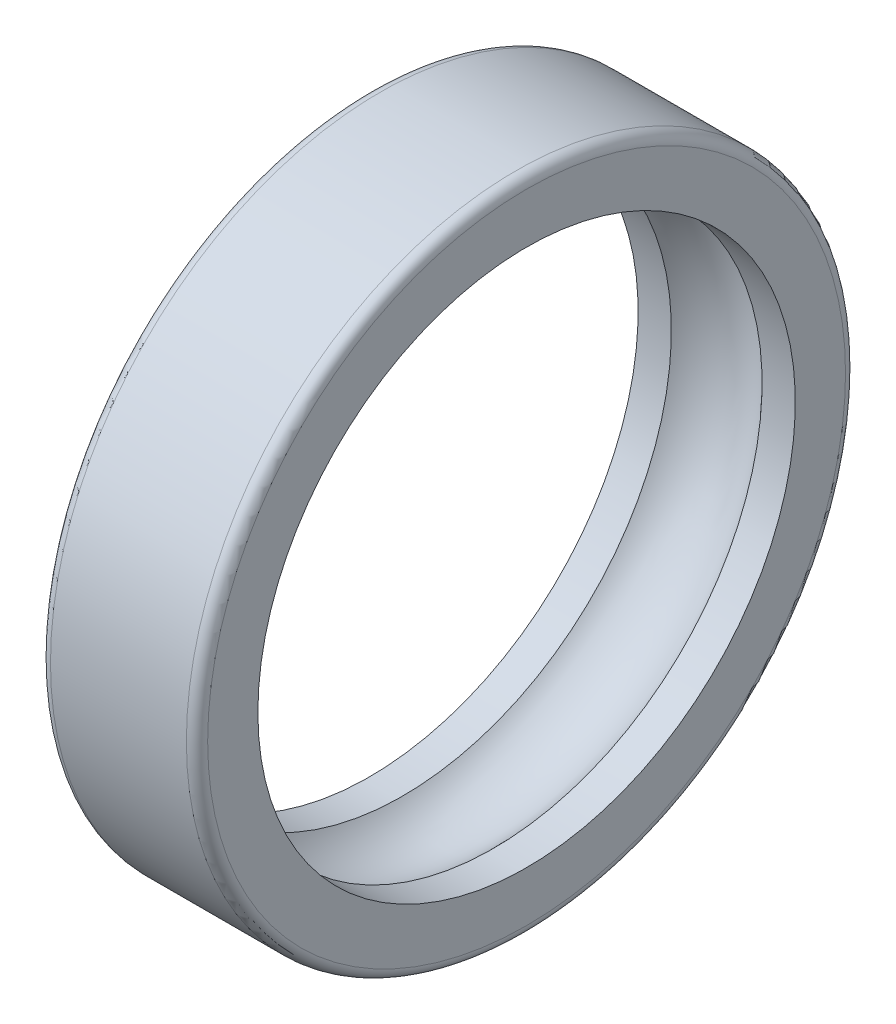
ISO-10303-21;
HEADER;
FILE_DESCRIPTION(('STEP AP214'),'2;1');
FILE_NAME('part.step','',(''),(''),'','','');
FILE_SCHEMA(('AUTOMOTIVE_DESIGN { 1 0 10303 214 1 1 1 1 }'));
ENDSEC;
DATA;
#1=APPLICATION_CONTEXT('core data for automotive mechanical design processes');
#2=APPLICATION_PROTOCOL_DEFINITION('international standard','automotive_design',2000,#1);
#3=PRODUCT_CONTEXT('',#1,'mechanical');
#4=PRODUCT('Part','Part','',(#3));
#5=PRODUCT_RELATED_PRODUCT_CATEGORY('part','',(#4));
#6=PRODUCT_DEFINITION_FORMATION('','',#4);
#7=PRODUCT_DEFINITION_CONTEXT('part definition',#1,'design');
#8=PRODUCT_DEFINITION('design','',#6,#7);
#9=PRODUCT_DEFINITION_SHAPE('','',#8);
#10=(LENGTH_UNIT() NAMED_UNIT(*) SI_UNIT(.MILLI.,.METRE.));
#11=(NAMED_UNIT(*) PLANE_ANGLE_UNIT() SI_UNIT($,.RADIAN.));
#12=(NAMED_UNIT(*) SI_UNIT($,.STERADIAN.) SOLID_ANGLE_UNIT());
#13=UNCERTAINTY_MEASURE_WITH_UNIT(LENGTH_MEASURE(1.E-05),#10,'distance_accuracy_value','');
#14=(GEOMETRIC_REPRESENTATION_CONTEXT(3) GLOBAL_UNCERTAINTY_ASSIGNED_CONTEXT((#13)) GLOBAL_UNIT_ASSIGNED_CONTEXT((#10,
#11,#12)) REPRESENTATION_CONTEXT('',''));
#15=CARTESIAN_POINT('',(0.,0.,0.));
#16=DIRECTION('',(0.,0.,1.));
#17=DIRECTION('',(1.,0.,0.));
#18=AXIS2_PLACEMENT_3D('',#15,#16,#17);
#19=CARTESIAN_POINT('',(-41.5277424491218,0.,0.));
#20=DIRECTION('',(-1.,0.,0.));
#21=DIRECTION('',(0.,0.,1.00000000000001));
#22=AXIS2_PLACEMENT_3D('',#19,#20,#21);
#23=CYLINDRICAL_SURFACE('',#22,53.);
#24=CARTESIAN_POINT('',(15.5,0.,0.));
#25=DIRECTION('',(-1.,0.,0.));
#26=DIRECTION('',(0.,0.,1.00000000000001));
#27=AXIS2_PLACEMENT_3D('',#24,#25,#26);
#28=CIRCLE('',#27,53.);
#29=CARTESIAN_POINT('',(15.5,0.,53.0000000000004));
#30=VERTEX_POINT('',#29);
#31=EDGE_CURVE('E64',#30,#30,#28,.T.);
#32=ORIENTED_EDGE('',*,*,#31,.F.);
#33=EDGE_LOOP('',(#32));
#34=FACE_BOUND('',#33,.T.);
#35=CARTESIAN_POINT('',(8.94427190999916,0.,0.));
#36=DIRECTION('',(-1.,0.,0.));
#37=DIRECTION('',(0.,0.,1.00000000000001));
#38=AXIS2_PLACEMENT_3D('',#35,#36,#37);
#39=CIRCLE('',#38,53.);
#40=CARTESIAN_POINT('',(8.94427190999916,0.,53.0000000000004));
#41=VERTEX_POINT('',#40);
#42=EDGE_CURVE('E76',#41,#41,#39,.T.);
#43=ORIENTED_EDGE('',*,*,#42,.T.);
#44=EDGE_LOOP('',(#43));
#45=FACE_BOUND('',#44,.T.);
#46=ADVANCED_FACE('F38',(#34,#45),#23,.F.);
#47=CARTESIAN_POINT('',(15.5,65.0000000000004,0.));
#48=DIRECTION('',(-1.,0.,0.));
#49=DIRECTION('',(0.,0.,1.00000000000001));
#50=AXIS2_PLACEMENT_3D('',#47,#48,#49);
#51=PLANE('',#50);
#52=CARTESIAN_POINT('',(15.5,0.,0.));
#53=DIRECTION('',(-1.,0.,0.));
#54=DIRECTION('',(0.,0.,1.00000000000001));
#55=AXIS2_PLACEMENT_3D('',#52,#53,#54);
#56=CIRCLE('',#55,62.9);
#57=CARTESIAN_POINT('',(15.5,0.,62.9000000000004));
#58=VERTEX_POINT('',#57);
#59=EDGE_CURVE('E46',#58,#58,#56,.F.);
#60=ORIENTED_EDGE('',*,*,#59,.T.);
#61=EDGE_LOOP('',(#60));
#62=FACE_BOUND('',#61,.T.);
#63=ORIENTED_EDGE('',*,*,#31,.T.);
#64=EDGE_LOOP('',(#63));
#65=FACE_BOUND('',#64,.T.);
#66=ADVANCED_FACE('F103',(#62,#65),#51,.F.);
#67=CARTESIAN_POINT('',(-41.5277424491218,0.,0.));
#68=DIRECTION('',(-1.,0.,0.));
#69=DIRECTION('',(0.,0.,1.00000000000001));
#70=AXIS2_PLACEMENT_3D('',#67,#68,#69);
#71=CYLINDRICAL_SURFACE('',#70,65.);
#72=CARTESIAN_POINT('',(13.4,0.,0.));
#73=DIRECTION('',(-1.,0.,0.));
#74=DIRECTION('',(0.,0.,1.00000000000001));
#75=AXIS2_PLACEMENT_3D('',#72,#73,#74);
#76=CIRCLE('',#75,65.);
#77=CARTESIAN_POINT('',(13.4,0.,65.0000000000004));
#78=VERTEX_POINT('',#77);
#79=EDGE_CURVE('E52',#78,#78,#76,.T.);
#80=ORIENTED_EDGE('',*,*,#79,.T.);
#81=EDGE_LOOP('',(#80));
#82=FACE_BOUND('',#81,.T.);
#83=CARTESIAN_POINT('',(-13.4,0.,0.));
#84=DIRECTION('',(1.,0.,0.));
#85=DIRECTION('',(0.,0.,-1.00000000000001));
#86=AXIS2_PLACEMENT_3D('',#83,#84,#85);
#87=CIRCLE('',#86,65.);
#88=CARTESIAN_POINT('',(-13.4,0.,-65.0000000000004));
#89=VERTEX_POINT('',#88);
#90=EDGE_CURVE('E58',#89,#89,#87,.T.);
#91=ORIENTED_EDGE('',*,*,#90,.T.);
#92=EDGE_LOOP('',(#91));
#93=FACE_BOUND('',#92,.T.);
#94=ADVANCED_FACE('F98',(#82,#93),#71,.T.);
#95=CARTESIAN_POINT('',(-15.5,65.0000000000004,0.));
#96=DIRECTION('',(1.,0.,0.));
#97=DIRECTION('',(0.,0.,-1.00000000000001));
#98=AXIS2_PLACEMENT_3D('',#95,#96,#97);
#99=PLANE('',#98);
#100=CARTESIAN_POINT('',(-15.5,0.,0.));
#101=DIRECTION('',(1.,0.,0.));
#102=DIRECTION('',(0.,0.,-1.00000000000001));
#103=AXIS2_PLACEMENT_3D('',#100,#101,#102);
#104=CIRCLE('',#103,62.9);
#105=CARTESIAN_POINT('',(-15.5,0.,-62.9000000000004));
#106=VERTEX_POINT('',#105);
#107=EDGE_CURVE('E10',#106,#106,#104,.F.);
#108=ORIENTED_EDGE('',*,*,#107,.T.);
#109=EDGE_LOOP('',(#108));
#110=FACE_BOUND('',#109,.T.);
#111=CARTESIAN_POINT('',(-15.5,0.,0.));
#112=DIRECTION('',(-1.,0.,0.));
#113=DIRECTION('',(0.,0.,1.00000000000001));
#114=AXIS2_PLACEMENT_3D('',#111,#112,#113);
#115=CIRCLE('',#114,53.);
#116=CARTESIAN_POINT('',(-15.5,0.,53.0000000000004));
#117=VERTEX_POINT('',#116);
#118=EDGE_CURVE('E68',#117,#117,#115,.T.);
#119=ORIENTED_EDGE('',*,*,#118,.F.);
#120=EDGE_LOOP('',(#119));
#121=FACE_BOUND('',#120,.T.);
#122=ADVANCED_FACE('F93',(#110,#121),#99,.F.);
#123=CARTESIAN_POINT('',(-41.5277424491218,0.,0.));
#124=DIRECTION('',(-1.,0.,0.));
#125=DIRECTION('',(0.,0.,1.00000000000001));
#126=AXIS2_PLACEMENT_3D('',#123,#124,#125);
#127=CYLINDRICAL_SURFACE('',#126,53.);
#128=CARTESIAN_POINT('',(-8.94427190999916,0.,0.));
#129=DIRECTION('',(-1.,0.,0.));
#130=DIRECTION('',(0.,0.,1.00000000000001));
#131=AXIS2_PLACEMENT_3D('',#128,#129,#130);
#132=CIRCLE('',#131,53.);
#133=CARTESIAN_POINT('',(-8.94427190999916,0.,53.0000000000004));
#134=VERTEX_POINT('',#133);
#135=EDGE_CURVE('E72',#134,#134,#132,.T.);
#136=ORIENTED_EDGE('',*,*,#135,.F.);
#137=EDGE_LOOP('',(#136));
#138=FACE_BOUND('',#137,.T.);
#139=ORIENTED_EDGE('',*,*,#118,.T.);
#140=EDGE_LOOP('',(#139));
#141=FACE_BOUND('',#140,.T.);
#142=ADVANCED_FACE('F87',(#138,#141),#127,.F.);
#143=CARTESIAN_POINT('',(0.,0.,0.));
#144=DIRECTION('',(-1.,0.,0.));
#145=DIRECTION('',(0.,0.,1.00000000000001));
#146=AXIS2_PLACEMENT_3D('',#143,#144,#145);
#147=TOROIDAL_SURFACE('',#146,45.,12.);
#148=ORIENTED_EDGE('',*,*,#42,.F.);
#149=EDGE_LOOP('',(#148));
#150=FACE_BOUND('',#149,.T.);
#151=ORIENTED_EDGE('',*,*,#135,.T.);
#152=EDGE_LOOP('',(#151));
#153=FACE_BOUND('',#152,.T.);
#154=ADVANCED_FACE('F83',(#150,#153),#147,.F.);
#155=CARTESIAN_POINT('',(13.4,0.,0.));
#156=DIRECTION('',(-1.,0.,0.));
#157=DIRECTION('',(0.,0.,1.00000000000001));
#158=AXIS2_PLACEMENT_3D('',#155,#156,#157);
#159=TOROIDAL_SURFACE('',#158,62.9,2.1);
#160=ORIENTED_EDGE('',*,*,#59,.F.);
#161=EDGE_LOOP('',(#160));
#162=FACE_BOUND('',#161,.T.);
#163=ORIENTED_EDGE('',*,*,#79,.F.);
#164=EDGE_LOOP('',(#163));
#165=FACE_BOUND('',#164,.T.);
#166=ADVANCED_FACE('F86',(#162,#165),#159,.T.);
#167=CARTESIAN_POINT('',(-13.4,0.,0.));
#168=DIRECTION('',(1.,0.,0.));
#169=DIRECTION('',(0.,0.,-1.00000000000001));
#170=AXIS2_PLACEMENT_3D('',#167,#168,#169);
#171=TOROIDAL_SURFACE('',#170,62.9,2.1);
#172=ORIENTED_EDGE('',*,*,#90,.F.);
#173=EDGE_LOOP('',(#172));
#174=FACE_BOUND('',#173,.T.);
#175=ORIENTED_EDGE('',*,*,#107,.F.);
#176=EDGE_LOOP('',(#175));
#177=FACE_BOUND('',#176,.T.);
#178=ADVANCED_FACE('F40',(#174,#177),#171,.T.);
#179=CLOSED_SHELL('',(#46,#66,#94,#122,#142,#154,#166,#178));
#180=MANIFOLD_SOLID_BREP('B2',#179);
#181=ADVANCED_BREP_SHAPE_REPRESENTATION('',(#18,#180),#14);
#182=SHAPE_DEFINITION_REPRESENTATION(#9,#181);
ENDSEC;
END-ISO-10303-21;
